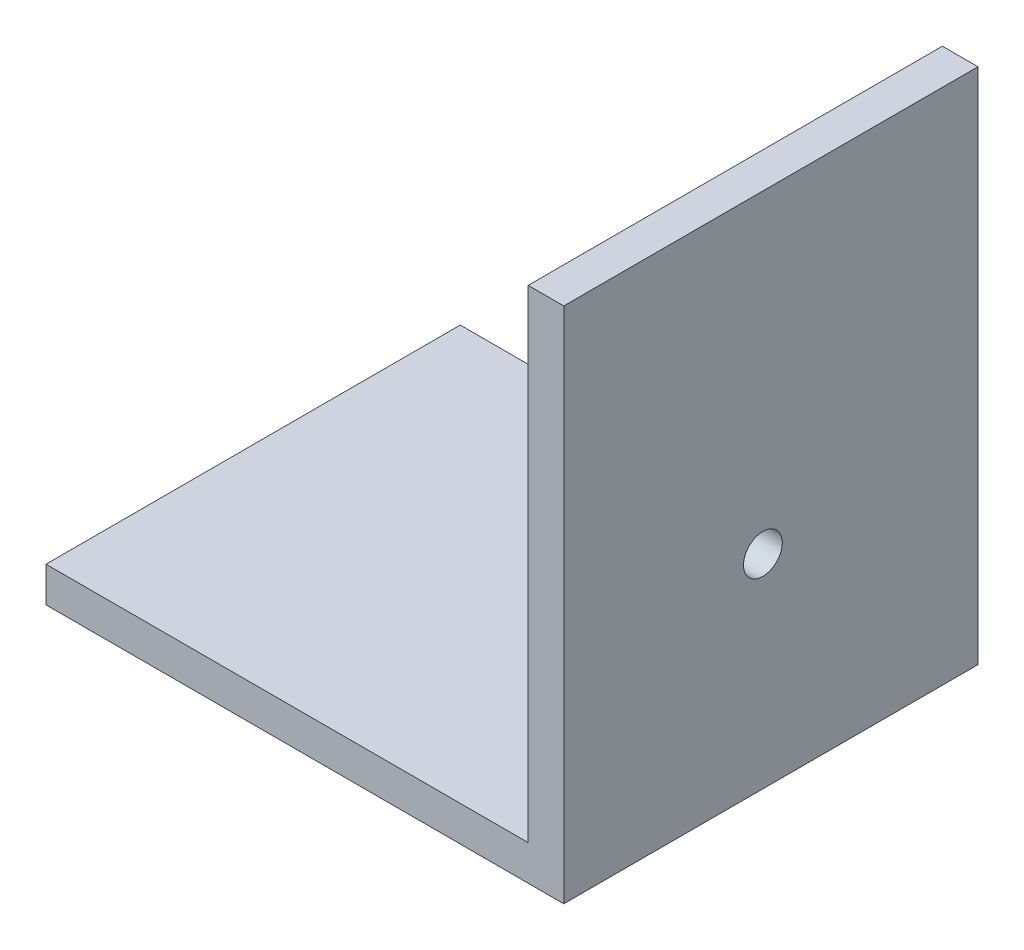
ISO-10303-21;
HEADER;
FILE_DESCRIPTION(('STEP AP214'),'2;1');
FILE_NAME('part.step','',(''),(''),'','','');
FILE_SCHEMA(('AUTOMOTIVE_DESIGN { 1 0 10303 214 1 1 1 1 }'));
ENDSEC;
DATA;
#1=APPLICATION_CONTEXT('core data for automotive mechanical design processes');
#2=APPLICATION_PROTOCOL_DEFINITION('international standard','automotive_design',2000,#1);
#3=PRODUCT_CONTEXT('',#1,'mechanical');
#4=PRODUCT('Part','Part','',(#3));
#5=PRODUCT_RELATED_PRODUCT_CATEGORY('part','',(#4));
#6=PRODUCT_DEFINITION_FORMATION('','',#4);
#7=PRODUCT_DEFINITION_CONTEXT('part definition',#1,'design');
#8=PRODUCT_DEFINITION('design','',#6,#7);
#9=PRODUCT_DEFINITION_SHAPE('','',#8);
#10=(LENGTH_UNIT() NAMED_UNIT(*) SI_UNIT(.MILLI.,.METRE.));
#11=(NAMED_UNIT(*) PLANE_ANGLE_UNIT() SI_UNIT($,.RADIAN.));
#12=(NAMED_UNIT(*) SI_UNIT($,.STERADIAN.) SOLID_ANGLE_UNIT());
#13=UNCERTAINTY_MEASURE_WITH_UNIT(LENGTH_MEASURE(1.E-05),#10,'distance_accuracy_value','');
#14=(GEOMETRIC_REPRESENTATION_CONTEXT(3) GLOBAL_UNCERTAINTY_ASSIGNED_CONTEXT((#13)) GLOBAL_UNIT_ASSIGNED_CONTEXT((#10,
#11,#12)) REPRESENTATION_CONTEXT('',''));
#15=CARTESIAN_POINT('',(0.,0.,0.));
#16=DIRECTION('',(0.,0.,1.));
#17=DIRECTION('',(1.,0.,0.));
#18=AXIS2_PLACEMENT_3D('',#15,#16,#17);
#19=CARTESIAN_POINT('',(-63.5,4.318,101.6));
#20=DIRECTION('',(0.,-1.,0.));
#21=DIRECTION('',(0.,0.,-1.));
#22=AXIS2_PLACEMENT_3D('',#19,#20,#21);
#23=PLANE('',#22);
#24=CARTESIAN_POINT('',(16.6624,4.318,50.8));
#25=DIRECTION('',(0.,1.,0.));
#26=DIRECTION('',(0.,0.,1.));
#27=AXIS2_PLACEMENT_3D('',#24,#25,#26);
#28=CIRCLE('',#27,6.34999999999999);
#29=CARTESIAN_POINT('',(16.6624,4.318,57.15));
#30=VERTEX_POINT('',#29);
#31=EDGE_CURVE('E217',#30,#30,#28,.T.);
#32=ORIENTED_EDGE('',*,*,#31,.F.);
#33=EDGE_LOOP('',(#32));
#34=FACE_BOUND('',#33,.T.);
#35=DIRECTION('',(0.,0.,1.));
#36=VECTOR('',#35,1.);
#37=CARTESIAN_POINT('',(54.7624,4.318,0.));
#38=LINE('',#37,#36);
#39=CARTESIAN_POINT('',(54.7624,4.318,0.));
#40=VERTEX_POINT('',#39);
#41=CARTESIAN_POINT('',(54.7624,4.318,101.6));
#42=VERTEX_POINT('',#41);
#43=EDGE_CURVE('E59',#40,#42,#38,.T.);
#44=ORIENTED_EDGE('',*,*,#43,.F.);
#45=DIRECTION('',(-1.,0.,0.));
#46=VECTOR('',#45,1.);
#47=CARTESIAN_POINT('',(-63.5,4.318,0.));
#48=LINE('',#47,#46);
#49=CARTESIAN_POINT('',(-63.5,4.318,0.));
#50=VERTEX_POINT('',#49);
#51=EDGE_CURVE('E81',#40,#50,#48,.T.);
#52=ORIENTED_EDGE('',*,*,#51,.T.);
#53=DIRECTION('',(0.,0.,-1.));
#54=VECTOR('',#53,1.);
#55=CARTESIAN_POINT('',(-63.5,4.318,101.6));
#56=LINE('',#55,#54);
#57=CARTESIAN_POINT('',(-63.5,4.318,101.6));
#58=VERTEX_POINT('',#57);
#59=EDGE_CURVE('E157',#58,#50,#56,.T.);
#60=ORIENTED_EDGE('',*,*,#59,.F.);
#61=DIRECTION('',(-1.,0.,0.));
#62=VECTOR('',#61,1.);
#63=CARTESIAN_POINT('',(-63.5,4.318,101.6));
#64=LINE('',#63,#62);
#65=EDGE_CURVE('E67',#42,#58,#64,.T.);
#66=ORIENTED_EDGE('',*,*,#65,.F.);
#67=EDGE_LOOP('',(#44,#52,#60,#66));
#68=FACE_BOUND('',#67,.T.);
#69=ADVANCED_FACE('F43',(#34,#68),#23,.F.);
#70=CARTESIAN_POINT('',(-63.5,4.318,101.6));
#71=DIRECTION('',(1.,0.,0.));
#72=DIRECTION('',(0.,0.,-1.));
#73=AXIS2_PLACEMENT_3D('',#70,#71,#72);
#74=PLANE('',#73);
#75=DIRECTION('',(0.,-1.,0.));
#76=VECTOR('',#75,1.);
#77=CARTESIAN_POINT('',(-63.5,4.318,0.));
#78=LINE('',#77,#76);
#79=CARTESIAN_POINT('',(-63.5,-4.318,0.));
#80=VERTEX_POINT('',#79);
#81=EDGE_CURVE('E145',#50,#80,#78,.T.);
#82=ORIENTED_EDGE('',*,*,#81,.T.);
#83=DIRECTION('',(0.,0.,-1.));
#84=VECTOR('',#83,1.);
#85=CARTESIAN_POINT('',(-63.5,-4.318,101.6));
#86=LINE('',#85,#84);
#87=CARTESIAN_POINT('',(-63.5,-4.318,101.6));
#88=VERTEX_POINT('',#87);
#89=EDGE_CURVE('E11',#88,#80,#86,.T.);
#90=ORIENTED_EDGE('',*,*,#89,.F.);
#91=DIRECTION('',(0.,-1.,0.));
#92=VECTOR('',#91,1.);
#93=CARTESIAN_POINT('',(-63.5,4.318,101.6));
#94=LINE('',#93,#92);
#95=EDGE_CURVE('E147',#58,#88,#94,.T.);
#96=ORIENTED_EDGE('',*,*,#95,.F.);
#97=ORIENTED_EDGE('',*,*,#59,.T.);
#98=EDGE_LOOP('',(#82,#90,#96,#97));
#99=FACE_BOUND('',#98,.T.);
#100=ADVANCED_FACE('F45',(#99),#74,.F.);
#101=CARTESIAN_POINT('',(-63.5,-4.318,101.6));
#102=DIRECTION('',(0.,1.,0.));
#103=DIRECTION('',(0.,0.,1.));
#104=AXIS2_PLACEMENT_3D('',#101,#102,#103);
#105=PLANE('',#104);
#106=CARTESIAN_POINT('',(16.6624,-4.318,50.8));
#107=DIRECTION('',(0.,1.,0.));
#108=DIRECTION('',(0.,0.,1.));
#109=AXIS2_PLACEMENT_3D('',#106,#107,#108);
#110=CIRCLE('',#109,6.35);
#111=CARTESIAN_POINT('',(16.6624,-4.318,57.15));
#112=VERTEX_POINT('',#111);
#113=EDGE_CURVE('E141',#112,#112,#110,.T.);
#114=ORIENTED_EDGE('',*,*,#113,.T.);
#115=EDGE_LOOP('',(#114));
#116=FACE_BOUND('',#115,.T.);
#117=DIRECTION('',(1.,0.,0.));
#118=VECTOR('',#117,1.);
#119=CARTESIAN_POINT('',(-63.5,-4.318,0.));
#120=LINE('',#119,#118);
#121=CARTESIAN_POINT('',(63.5,-4.318,0.));
#122=VERTEX_POINT('',#121);
#123=EDGE_CURVE('E113',#80,#122,#120,.T.);
#124=ORIENTED_EDGE('',*,*,#123,.T.);
#125=DIRECTION('',(0.,0.,-1.));
#126=VECTOR('',#125,1.);
#127=CARTESIAN_POINT('',(63.5,-4.318,101.6));
#128=LINE('',#127,#126);
#129=CARTESIAN_POINT('',(63.5,-4.318,101.6));
#130=VERTEX_POINT('',#129);
#131=EDGE_CURVE('E52',#130,#122,#128,.T.);
#132=ORIENTED_EDGE('',*,*,#131,.F.);
#133=DIRECTION('',(1.,0.,0.));
#134=VECTOR('',#133,1.);
#135=CARTESIAN_POINT('',(-63.5,-4.318,101.6));
#136=LINE('',#135,#134);
#137=EDGE_CURVE('E86',#88,#130,#136,.T.);
#138=ORIENTED_EDGE('',*,*,#137,.F.);
#139=ORIENTED_EDGE('',*,*,#89,.T.);
#140=EDGE_LOOP('',(#124,#132,#138,#139));
#141=FACE_BOUND('',#140,.T.);
#142=ADVANCED_FACE('F170',(#116,#141),#105,.F.);
#143=CARTESIAN_POINT('',(63.5,4.318,101.6));
#144=DIRECTION('',(-1.,0.,0.));
#145=DIRECTION('',(0.,0.,1.));
#146=AXIS2_PLACEMENT_3D('',#143,#144,#145);
#147=PLANE('',#146);
#148=CARTESIAN_POINT('',(63.5,45.593,52.7653860820474));
#149=DIRECTION('',(-1.,0.,0.));
#150=DIRECTION('',(0.,0.,1.));
#151=AXIS2_PLACEMENT_3D('',#148,#149,#150);
#152=CIRCLE('',#151,4.7625);
#153=CARTESIAN_POINT('',(63.5,45.593,57.5278860820474));
#154=VERTEX_POINT('',#153);
#155=EDGE_CURVE('E210',#154,#154,#152,.T.);
#156=ORIENTED_EDGE('',*,*,#155,.T.);
#157=EDGE_LOOP('',(#156));
#158=FACE_BOUND('',#157,.T.);
#159=DIRECTION('',(0.,1.,0.));
#160=VECTOR('',#159,1.);
#161=CARTESIAN_POINT('',(63.5,4.318,0.));
#162=LINE('',#161,#160);
#163=CARTESIAN_POINT('',(63.5,122.682,0.));
#164=VERTEX_POINT('',#163);
#165=EDGE_CURVE('E104',#122,#164,#162,.T.);
#166=ORIENTED_EDGE('',*,*,#165,.T.);
#167=DIRECTION('',(0.,0.,1.));
#168=VECTOR('',#167,1.);
#169=CARTESIAN_POINT('',(63.5,122.682,0.));
#170=LINE('',#169,#168);
#171=CARTESIAN_POINT('',(63.5,122.682,101.6));
#172=VERTEX_POINT('',#171);
#173=EDGE_CURVE('E108',#164,#172,#170,.T.);
#174=ORIENTED_EDGE('',*,*,#173,.T.);
#175=DIRECTION('',(0.,1.,0.));
#176=VECTOR('',#175,1.);
#177=CARTESIAN_POINT('',(63.5,4.318,101.6));
#178=LINE('',#177,#176);
#179=EDGE_CURVE('E152',#130,#172,#178,.T.);
#180=ORIENTED_EDGE('',*,*,#179,.F.);
#181=ORIENTED_EDGE('',*,*,#131,.T.);
#182=EDGE_LOOP('',(#166,#174,#180,#181));
#183=FACE_BOUND('',#182,.T.);
#184=ADVANCED_FACE('F106',(#158,#183),#147,.F.);
#185=CARTESIAN_POINT('',(0.,0.,101.6));
#186=DIRECTION('',(0.,0.,1.));
#187=DIRECTION('',(1.,0.,0.));
#188=AXIS2_PLACEMENT_3D('',#185,#186,#187);
#189=PLANE('',#188);
#190=ORIENTED_EDGE('',*,*,#95,.T.);
#191=ORIENTED_EDGE('',*,*,#137,.T.);
#192=ORIENTED_EDGE('',*,*,#179,.T.);
#193=DIRECTION('',(-1.,0.,0.));
#194=VECTOR('',#193,1.);
#195=CARTESIAN_POINT('',(0.,122.682,101.6));
#196=LINE('',#195,#194);
#197=CARTESIAN_POINT('',(54.7624,122.682,101.6));
#198=VERTEX_POINT('',#197);
#199=EDGE_CURVE('E120',#172,#198,#196,.T.);
#200=ORIENTED_EDGE('',*,*,#199,.T.);
#201=DIRECTION('',(0.,1.,0.));
#202=VECTOR('',#201,1.);
#203=CARTESIAN_POINT('',(54.7624,0.,101.6));
#204=LINE('',#203,#202);
#205=EDGE_CURVE('E137',#42,#198,#204,.T.);
#206=ORIENTED_EDGE('',*,*,#205,.F.);
#207=ORIENTED_EDGE('',*,*,#65,.T.);
#208=EDGE_LOOP('',(#190,#191,#192,#200,#206,#207));
#209=FACE_BOUND('',#208,.T.);
#210=ADVANCED_FACE('F177',(#209),#189,.T.);
#211=CARTESIAN_POINT('',(0.,0.,0.));
#212=DIRECTION('',(0.,0.,1.));
#213=DIRECTION('',(1.,0.,0.));
#214=AXIS2_PLACEMENT_3D('',#211,#212,#213);
#215=PLANE('',#214);
#216=ORIENTED_EDGE('',*,*,#81,.F.);
#217=ORIENTED_EDGE('',*,*,#51,.F.);
#218=DIRECTION('',(0.,1.,0.));
#219=VECTOR('',#218,1.);
#220=CARTESIAN_POINT('',(54.7624,0.,0.));
#221=LINE('',#220,#219);
#222=CARTESIAN_POINT('',(54.7624,122.682,0.));
#223=VERTEX_POINT('',#222);
#224=EDGE_CURVE('E127',#40,#223,#221,.T.);
#225=ORIENTED_EDGE('',*,*,#224,.T.);
#226=DIRECTION('',(-1.,0.,0.));
#227=VECTOR('',#226,1.);
#228=CARTESIAN_POINT('',(0.,122.682,0.));
#229=LINE('',#228,#227);
#230=EDGE_CURVE('E118',#164,#223,#229,.T.);
#231=ORIENTED_EDGE('',*,*,#230,.F.);
#232=ORIENTED_EDGE('',*,*,#165,.F.);
#233=ORIENTED_EDGE('',*,*,#123,.F.);
#234=EDGE_LOOP('',(#216,#217,#225,#231,#232,#233));
#235=FACE_BOUND('',#234,.T.);
#236=ADVANCED_FACE('F125',(#235),#215,.F.);
#237=CARTESIAN_POINT('',(54.7624,0.,0.));
#238=DIRECTION('',(1.,0.,0.));
#239=DIRECTION('',(0.,0.,-1.));
#240=AXIS2_PLACEMENT_3D('',#237,#238,#239);
#241=PLANE('',#240);
#242=CARTESIAN_POINT('',(54.7624,45.593,52.7653860820474));
#243=DIRECTION('',(-1.,0.,0.));
#244=DIRECTION('',(0.,0.,1.));
#245=AXIS2_PLACEMENT_3D('',#242,#243,#244);
#246=CIRCLE('',#245,4.7625);
#247=CARTESIAN_POINT('',(54.7624,45.593,57.5278860820474));
#248=VERTEX_POINT('',#247);
#249=EDGE_CURVE('E213',#248,#248,#246,.T.);
#250=ORIENTED_EDGE('',*,*,#249,.F.);
#251=EDGE_LOOP('',(#250));
#252=FACE_BOUND('',#251,.T.);
#253=ORIENTED_EDGE('',*,*,#205,.T.);
#254=DIRECTION('',(0.,0.,1.));
#255=VECTOR('',#254,1.);
#256=CARTESIAN_POINT('',(54.7624,122.682,0.));
#257=LINE('',#256,#255);
#258=EDGE_CURVE('E122',#223,#198,#257,.T.);
#259=ORIENTED_EDGE('',*,*,#258,.F.);
#260=ORIENTED_EDGE('',*,*,#224,.F.);
#261=ORIENTED_EDGE('',*,*,#43,.T.);
#262=EDGE_LOOP('',(#253,#259,#260,#261));
#263=FACE_BOUND('',#262,.T.);
#264=ADVANCED_FACE('F190',(#252,#263),#241,.F.);
#265=CARTESIAN_POINT('',(0.,122.682,0.));
#266=DIRECTION('',(0.,1.,0.));
#267=DIRECTION('',(0.,0.,1.));
#268=AXIS2_PLACEMENT_3D('',#265,#266,#267);
#269=PLANE('',#268);
#270=ORIENTED_EDGE('',*,*,#199,.F.);
#271=ORIENTED_EDGE('',*,*,#173,.F.);
#272=ORIENTED_EDGE('',*,*,#230,.T.);
#273=ORIENTED_EDGE('',*,*,#258,.T.);
#274=EDGE_LOOP('',(#270,#271,#272,#273));
#275=FACE_BOUND('',#274,.T.);
#276=ADVANCED_FACE('F117',(#275),#269,.T.);
#277=CARTESIAN_POINT('',(16.6624,4.318,50.8));
#278=DIRECTION('',(0.,1.,0.));
#279=DIRECTION('',(0.,0.,1.));
#280=AXIS2_PLACEMENT_3D('',#277,#278,#279);
#281=CYLINDRICAL_SURFACE('',#280,6.34999999999999);
#282=ORIENTED_EDGE('',*,*,#113,.F.);
#283=EDGE_LOOP('',(#282));
#284=FACE_BOUND('',#283,.T.);
#285=ORIENTED_EDGE('',*,*,#31,.T.);
#286=EDGE_LOOP('',(#285));
#287=FACE_BOUND('',#286,.T.);
#288=ADVANCED_FACE('F198',(#284,#287),#281,.F.);
#289=CARTESIAN_POINT('',(54.7624,45.593,52.7653860820474));
#290=DIRECTION('',(-1.,0.,0.));
#291=DIRECTION('',(0.,0.,1.));
#292=AXIS2_PLACEMENT_3D('',#289,#290,#291);
#293=CYLINDRICAL_SURFACE('',#292,4.7625);
#294=ORIENTED_EDGE('',*,*,#155,.F.);
#295=EDGE_LOOP('',(#294));
#296=FACE_BOUND('',#295,.T.);
#297=ORIENTED_EDGE('',*,*,#249,.T.);
#298=EDGE_LOOP('',(#297));
#299=FACE_BOUND('',#298,.T.);
#300=ADVANCED_FACE('F201',(#296,#299),#293,.F.);
#301=CLOSED_SHELL('',(#69,#100,#142,#184,#210,#236,#264,#276,#288,#300));
#302=MANIFOLD_SOLID_BREP('B2',#301);
#303=ADVANCED_BREP_SHAPE_REPRESENTATION('',(#18,#302),#14);
#304=SHAPE_DEFINITION_REPRESENTATION(#9,#303);
ENDSEC;
END-ISO-10303-21;
